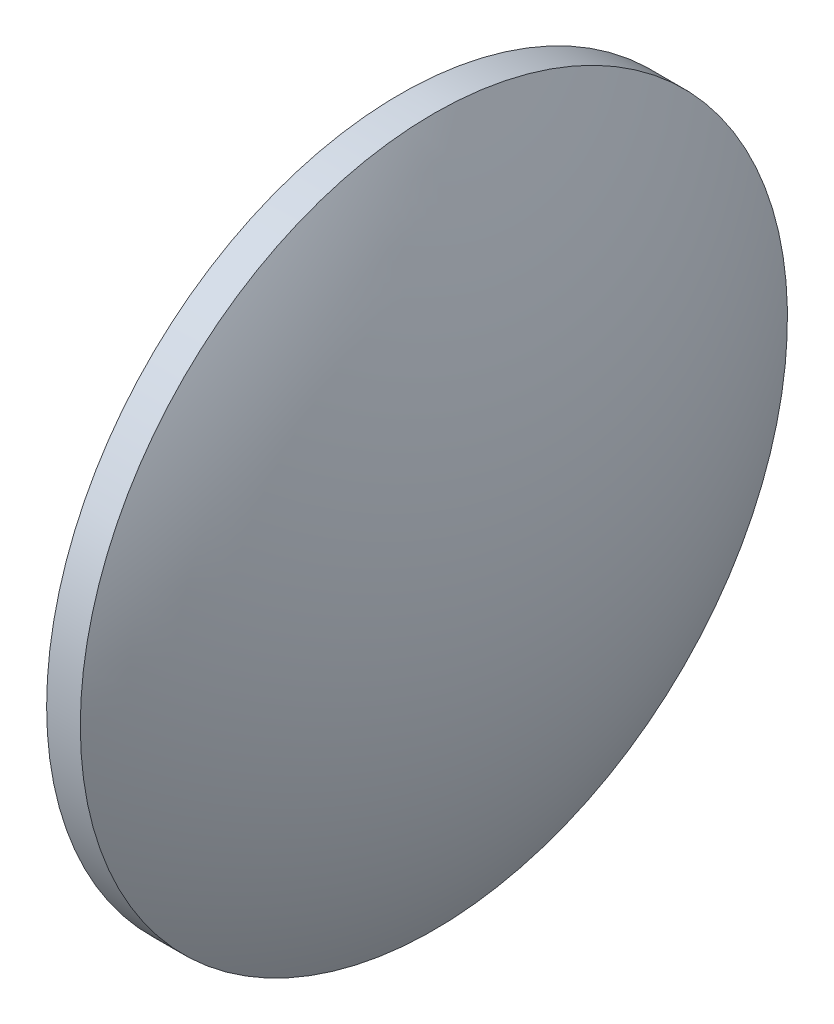
ISO-10303-21;
HEADER;
FILE_DESCRIPTION(('STEP AP214'),'2;1');
FILE_NAME('part.step','',(''),(''),'','','');
FILE_SCHEMA(('AUTOMOTIVE_DESIGN { 1 0 10303 214 1 1 1 1 }'));
ENDSEC;
DATA;
#1=APPLICATION_CONTEXT('core data for automotive mechanical design processes');
#2=APPLICATION_PROTOCOL_DEFINITION('international standard','automotive_design',2000,#1);
#3=PRODUCT_CONTEXT('',#1,'mechanical');
#4=PRODUCT('Part','Part','',(#3));
#5=PRODUCT_RELATED_PRODUCT_CATEGORY('part','',(#4));
#6=PRODUCT_DEFINITION_FORMATION('','',#4);
#7=PRODUCT_DEFINITION_CONTEXT('part definition',#1,'design');
#8=PRODUCT_DEFINITION('design','',#6,#7);
#9=PRODUCT_DEFINITION_SHAPE('','',#8);
#10=(LENGTH_UNIT() NAMED_UNIT(*) SI_UNIT(.MILLI.,.METRE.));
#11=(NAMED_UNIT(*) PLANE_ANGLE_UNIT() SI_UNIT($,.RADIAN.));
#12=(NAMED_UNIT(*) SI_UNIT($,.STERADIAN.) SOLID_ANGLE_UNIT());
#13=UNCERTAINTY_MEASURE_WITH_UNIT(LENGTH_MEASURE(1.E-05),#10,'distance_accuracy_value','');
#14=(GEOMETRIC_REPRESENTATION_CONTEXT(3) GLOBAL_UNCERTAINTY_ASSIGNED_CONTEXT((#13)) GLOBAL_UNIT_ASSIGNED_CONTEXT((#10,
#11,#12)) REPRESENTATION_CONTEXT('',''));
#15=CARTESIAN_POINT('',(0.,0.,0.));
#16=DIRECTION('',(0.,0.,1.));
#17=DIRECTION('',(1.,0.,0.));
#18=AXIS2_PLACEMENT_3D('',#15,#16,#17);
#19=CARTESIAN_POINT('',(173.568946555589,130.518581456956,0.));
#20=DIRECTION('',(-1.,0.,0.));
#21=DIRECTION('',(0.,1.,0.));
#22=AXIS2_PLACEMENT_3D('',#19,#20,#21);
#23=SPHERICAL_SURFACE('',#22,64.5343544457977);
#24=CARTESIAN_POINT('',(229.893301001387,130.518581456956,0.));
#25=DIRECTION('',(-1.,0.,0.));
#26=DIRECTION('',(0.,0.,1.));
#27=AXIS2_PLACEMENT_3D('',#24,#25,#26);
#28=CIRCLE('',#27,31.5);
#29=CARTESIAN_POINT('',(229.893301001387,130.518581456956,31.5));
#30=VERTEX_POINT('',#29);
#31=EDGE_CURVE('E10',#30,#30,#28,.T.);
#32=ORIENTED_EDGE('',*,*,#31,.F.);
#33=EDGE_LOOP('',(#32));
#34=FACE_BOUND('',#33,.T.);
#35=ADVANCED_FACE('F35',(#34),#23,.T.);
#36=CARTESIAN_POINT('',(218.123666737155,130.518581456956,0.));
#37=DIRECTION('',(-1.,0.,0.));
#38=DIRECTION('',(0.,0.,1.));
#39=AXIS2_PLACEMENT_3D('',#36,#37,#38);
#40=CYLINDRICAL_SURFACE('',#39,31.5);
#41=CARTESIAN_POINT('',(226.893301001387,130.518581456956,0.));
#42=DIRECTION('',(-1.,0.,0.));
#43=DIRECTION('',(0.,0.,1.));
#44=AXIS2_PLACEMENT_3D('',#41,#42,#43);
#45=CIRCLE('',#44,31.5);
#46=CARTESIAN_POINT('',(226.893301001387,130.518581456956,31.5));
#47=VERTEX_POINT('',#46);
#48=EDGE_CURVE('E41',#47,#47,#45,.T.);
#49=ORIENTED_EDGE('',*,*,#48,.F.);
#50=EDGE_LOOP('',(#49));
#51=FACE_BOUND('',#50,.T.);
#52=ORIENTED_EDGE('',*,*,#31,.T.);
#53=EDGE_LOOP('',(#52));
#54=FACE_BOUND('',#53,.T.);
#55=ADVANCED_FACE('F49',(#51,#54),#40,.T.);
#56=CARTESIAN_POINT('',(226.893301001387,130.518581456956,0.));
#57=DIRECTION('',(1.,0.,0.));
#58=DIRECTION('',(0.,0.,-1.));
#59=AXIS2_PLACEMENT_3D('',#56,#57,#58);
#60=PLANE('',#59);
#61=ORIENTED_EDGE('',*,*,#48,.T.);
#62=EDGE_LOOP('',(#61));
#63=FACE_BOUND('',#62,.T.);
#64=ADVANCED_FACE('F47',(#63),#60,.F.);
#65=CLOSED_SHELL('',(#35,#55,#64));
#66=MANIFOLD_SOLID_BREP('B2',#65);
#67=ADVANCED_BREP_SHAPE_REPRESENTATION('',(#18,#66),#14);
#68=SHAPE_DEFINITION_REPRESENTATION(#9,#67);
ENDSEC;
END-ISO-10303-21;
